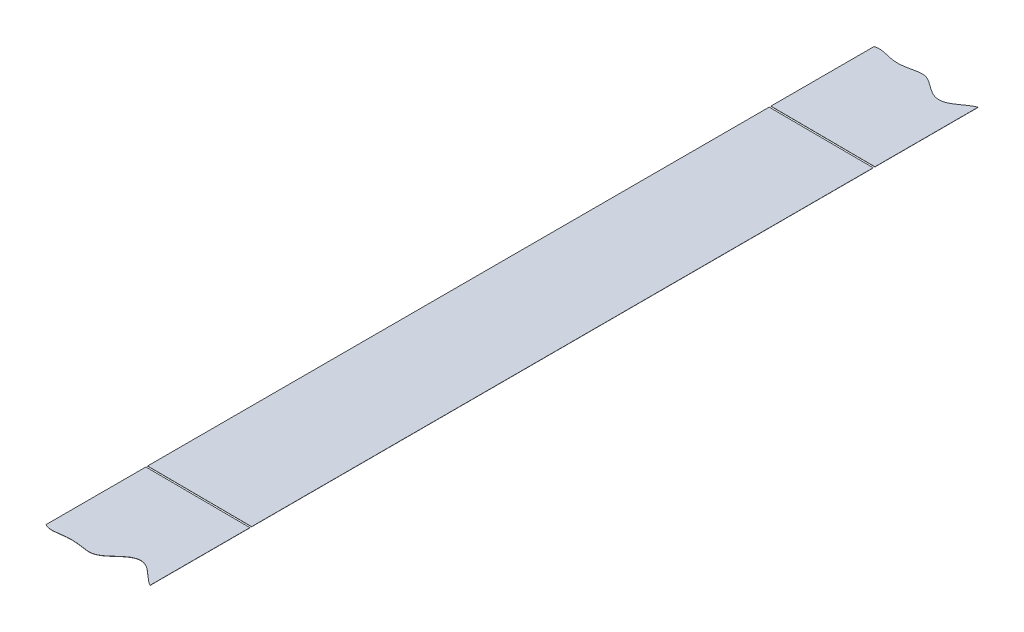
ISO-10303-21;
HEADER;
FILE_DESCRIPTION(('STEP AP214'),'2;1');
FILE_NAME('part.step','',(''),(''),'','','');
FILE_SCHEMA(('AUTOMOTIVE_DESIGN { 1 0 10303 214 1 1 1 1 }'));
ENDSEC;
DATA;
#1=APPLICATION_CONTEXT('core data for automotive mechanical design processes');
#2=APPLICATION_PROTOCOL_DEFINITION('international standard','automotive_design',2000,#1);
#3=PRODUCT_CONTEXT('',#1,'mechanical');
#4=PRODUCT('Part','Part','',(#3));
#5=PRODUCT_RELATED_PRODUCT_CATEGORY('part','',(#4));
#6=PRODUCT_DEFINITION_FORMATION('','',#4);
#7=PRODUCT_DEFINITION_CONTEXT('part definition',#1,'design');
#8=PRODUCT_DEFINITION('design','',#6,#7);
#9=PRODUCT_DEFINITION_SHAPE('','',#8);
#10=(LENGTH_UNIT() NAMED_UNIT(*) SI_UNIT(.MILLI.,.METRE.));
#11=(NAMED_UNIT(*) PLANE_ANGLE_UNIT() SI_UNIT($,.RADIAN.));
#12=(NAMED_UNIT(*) SI_UNIT($,.STERADIAN.) SOLID_ANGLE_UNIT());
#13=UNCERTAINTY_MEASURE_WITH_UNIT(LENGTH_MEASURE(1.E-05),#10,'distance_accuracy_value','');
#14=(GEOMETRIC_REPRESENTATION_CONTEXT(3) GLOBAL_UNCERTAINTY_ASSIGNED_CONTEXT((#13)) GLOBAL_UNIT_ASSIGNED_CONTEXT((#10,
#11,#12)) REPRESENTATION_CONTEXT('',''));
#15=CARTESIAN_POINT('',(0.,0.,0.));
#16=DIRECTION('',(0.,0.,1.));
#17=DIRECTION('',(1.,0.,0.));
#18=AXIS2_PLACEMENT_3D('',#15,#16,#17);
#19=CARTESIAN_POINT('',(5361.79707301312,-34.5969939588689,-4952.40178139495));
#20=DIRECTION('',(-0.00526315789472435,-0.999986149488569,0.));
#21=DIRECTION('',(0.999986149488569,-0.00526315789472435,0.));
#22=AXIS2_PLACEMENT_3D('',#19,#20,#21);
#23=PLANE('',#22);
#24=DIRECTION('',(0.,0.,-1.));
#25=VECTOR('',#24,1.);
#26=CARTESIAN_POINT('',(593.409266168176,-9.49986842014141,292.897456211538));
#27=LINE('',#26,#25);
#28=CARTESIAN_POINT('',(593.409266168176,-9.49986842014141,234.429573526086));
#29=VERTEX_POINT('',#28);
#30=CARTESIAN_POINT('',(593.409266168176,-9.49986842014141,-123.570426473914));
#31=VERTEX_POINT('',#30);
#32=EDGE_CURVE('E53',#29,#31,#27,.T.);
#33=ORIENTED_EDGE('',*,*,#32,.T.);
#34=DIRECTION('',(-0.999986149488569,0.00526315789472435,0.));
#35=VECTOR('',#34,1.);
#36=CARTESIAN_POINT('',(5361.79707301312,-34.5969939588688,-123.570426473914));
#37=LINE('',#36,#35);
#38=CARTESIAN_POINT('',(533.50620296407,-9.18458477328079,-123.570426473914));
#39=VERTEX_POINT('',#38);
#40=EDGE_CURVE('E68',#31,#39,#37,.T.);
#41=ORIENTED_EDGE('',*,*,#40,.T.);
#42=DIRECTION('',(0.,0.,-1.));
#43=VECTOR('',#42,1.);
#44=CARTESIAN_POINT('',(533.50620296407,-9.18458477328079,292.948408765323));
#45=LINE('',#44,#43);
#46=CARTESIAN_POINT('',(533.506202964069,-9.18458477328079,234.429573526086));
#47=VERTEX_POINT('',#46);
#48=EDGE_CURVE('E110',#47,#39,#45,.T.);
#49=ORIENTED_EDGE('',*,*,#48,.F.);
#50=DIRECTION('',(0.999986149488569,-0.00526315789472435,0.));
#51=VECTOR('',#50,1.);
#52=CARTESIAN_POINT('',(5361.79707301312,-34.5969939588688,234.429573526086));
#53=LINE('',#52,#51);
#54=EDGE_CURVE('E116',#47,#29,#53,.T.);
#55=ORIENTED_EDGE('',*,*,#54,.T.);
#56=EDGE_LOOP('',(#33,#41,#49,#55));
#57=FACE_BOUND('',#56,.T.);
#58=ADVANCED_FACE('F50',(#57),#23,.F.);
#59=CARTESIAN_POINT('',(5361.79654669733,-34.6969925738177,-4952.40178139495));
#60=DIRECTION('',(-0.00526315789472435,-0.999986149488569,0.));
#61=DIRECTION('',(0.999986149488569,-0.00526315789472435,0.));
#62=AXIS2_PLACEMENT_3D('',#59,#60,#61);
#63=PLANE('',#62);
#64=DIRECTION('',(-0.999986149488569,0.00526315789472435,0.));
#65=VECTOR('',#64,1.);
#66=CARTESIAN_POINT('',(533.50567664828,-9.28458338822965,-123.570426473914));
#67=LINE('',#66,#65);
#68=CARTESIAN_POINT('',(593.408739852387,-9.59986703509027,-123.570426473914));
#69=VERTEX_POINT('',#68);
#70=CARTESIAN_POINT('',(533.50567664828,-9.28458338822965,-123.570426473914));
#71=VERTEX_POINT('',#70);
#72=EDGE_CURVE('E14',#69,#71,#67,.T.);
#73=ORIENTED_EDGE('',*,*,#72,.F.);
#74=DIRECTION('',(0.,0.,-1.));
#75=VECTOR('',#74,1.);
#76=CARTESIAN_POINT('',(593.408739852386,-9.59986703509026,292.897456211538));
#77=LINE('',#76,#75);
#78=CARTESIAN_POINT('',(593.408739852387,-9.59986703509027,234.429573526086));
#79=VERTEX_POINT('',#78);
#80=EDGE_CURVE('E98',#79,#69,#77,.T.);
#81=ORIENTED_EDGE('',*,*,#80,.F.);
#82=DIRECTION('',(0.999986149488569,-0.00526315789472435,0.));
#83=VECTOR('',#82,1.);
#84=CARTESIAN_POINT('',(533.50567664828,-9.28458338822965,234.429573526086));
#85=LINE('',#84,#83);
#86=CARTESIAN_POINT('',(533.50567664828,-9.28458338822965,234.429573526086));
#87=VERTEX_POINT('',#86);
#88=EDGE_CURVE('E91',#87,#79,#85,.T.);
#89=ORIENTED_EDGE('',*,*,#88,.F.);
#90=DIRECTION('',(0.,0.,-1.));
#91=VECTOR('',#90,1.);
#92=CARTESIAN_POINT('',(533.50567664828,-9.28458338822965,292.948408765323));
#93=LINE('',#92,#91);
#94=EDGE_CURVE('E100',#87,#71,#93,.T.);
#95=ORIENTED_EDGE('',*,*,#94,.T.);
#96=EDGE_LOOP('',(#73,#81,#89,#95));
#97=FACE_BOUND('',#96,.T.);
#98=ADVANCED_FACE('F96',(#97),#63,.T.);
#99=CARTESIAN_POINT('',(533.50567664828,-9.28458338822965,292.948408765323));
#100=DIRECTION('',(0.999986149488569,-0.00526315789473041,0.));
#101=DIRECTION('',(0.00526315789473041,0.999986149488569,0.));
#102=AXIS2_PLACEMENT_3D('',#99,#100,#101);
#103=PLANE('',#102);
#104=ORIENTED_EDGE('',*,*,#48,.T.);
#105=DIRECTION('',(-0.00526315789472435,-0.999986149488569,0.));
#106=VECTOR('',#105,1.);
#107=CARTESIAN_POINT('',(533.558308227227,0.71527810665604,-123.570426473914));
#108=LINE('',#107,#106);
#109=EDGE_CURVE('E107',#39,#71,#108,.T.);
#110=ORIENTED_EDGE('',*,*,#109,.T.);
#111=ORIENTED_EDGE('',*,*,#94,.F.);
#112=DIRECTION('',(-0.00526315789472435,-0.999986149488569,0.));
#113=VECTOR('',#112,1.);
#114=CARTESIAN_POINT('',(533.558308227227,0.71527810665604,234.429573526086));
#115=LINE('',#114,#113);
#116=EDGE_CURVE('E104',#47,#87,#115,.T.);
#117=ORIENTED_EDGE('',*,*,#116,.F.);
#118=EDGE_LOOP('',(#104,#110,#111,#117));
#119=FACE_BOUND('',#118,.T.);
#120=ADVANCED_FACE('F124',(#119),#103,.F.);
#121=CARTESIAN_POINT('',(593.408739852386,-9.59986703509026,292.897456211538));
#122=DIRECTION('',(0.999986149488569,-0.00526315789473041,0.));
#123=DIRECTION('',(0.00526315789473041,0.999986149488569,0.));
#124=AXIS2_PLACEMENT_3D('',#121,#122,#123);
#125=PLANE('',#124);
#126=DIRECTION('',(-0.00526315789473041,-0.999986149488569,0.));
#127=VECTOR('',#126,1.);
#128=CARTESIAN_POINT('',(593.408739852386,-9.59986703509026,-123.570426473914));
#129=LINE('',#128,#127);
#130=EDGE_CURVE('E59',#31,#69,#129,.T.);
#131=ORIENTED_EDGE('',*,*,#130,.F.);
#132=ORIENTED_EDGE('',*,*,#32,.F.);
#133=DIRECTION('',(-0.00526315789472435,-0.999986149488569,0.));
#134=VECTOR('',#133,1.);
#135=CARTESIAN_POINT('',(593.461371431334,0.399994459795421,234.429573526086));
#136=LINE('',#135,#134);
#137=EDGE_CURVE('E103',#29,#79,#136,.T.);
#138=ORIENTED_EDGE('',*,*,#137,.T.);
#139=ORIENTED_EDGE('',*,*,#80,.T.);
#140=EDGE_LOOP('',(#131,#132,#138,#139));
#141=FACE_BOUND('',#140,.T.);
#142=ADVANCED_FACE('F102',(#141),#125,.T.);
#143=CARTESIAN_POINT('',(533.558308227227,0.71527810665604,234.429573526086));
#144=DIRECTION('',(0.,0.,-1.));
#145=DIRECTION('',(0.,1.,0.));
#146=AXIS2_PLACEMENT_3D('',#143,#144,#145);
#147=PLANE('',#146);
#148=ORIENTED_EDGE('',*,*,#116,.T.);
#149=ORIENTED_EDGE('',*,*,#88,.T.);
#150=ORIENTED_EDGE('',*,*,#137,.F.);
#151=ORIENTED_EDGE('',*,*,#54,.F.);
#152=EDGE_LOOP('',(#148,#149,#150,#151));
#153=FACE_BOUND('',#152,.T.);
#154=ADVANCED_FACE('F123',(#153),#147,.F.);
#155=CARTESIAN_POINT('',(533.558308227227,0.71527810665604,-123.570426473914));
#156=DIRECTION('',(0.,0.,1.));
#157=DIRECTION('',(0.,-1.,0.));
#158=AXIS2_PLACEMENT_3D('',#155,#156,#157);
#159=PLANE('',#158);
#160=ORIENTED_EDGE('',*,*,#130,.T.);
#161=ORIENTED_EDGE('',*,*,#72,.T.);
#162=ORIENTED_EDGE('',*,*,#109,.F.);
#163=ORIENTED_EDGE('',*,*,#40,.F.);
#164=EDGE_LOOP('',(#160,#161,#162,#163));
#165=FACE_BOUND('',#164,.T.);
#166=ADVANCED_FACE('F86',(#165),#159,.F.);
#167=CLOSED_SHELL('',(#58,#98,#120,#142,#154,#166));
#168=MANIFOLD_SOLID_BREP('B2',#167);
#169=CARTESIAN_POINT('',(593.408739852386,-9.59986703509026,292.897456211538));
#170=DIRECTION('',(0.999986149488569,-0.00526315789473041,0.));
#171=DIRECTION('',(0.00526315789473041,0.999986149488569,0.));
#172=AXIS2_PLACEMENT_3D('',#169,#170,#171);
#173=PLANE('',#172);
#174=DIRECTION('',(-0.00526315789472435,-0.999986149488569,0.));
#175=VECTOR('',#174,1.);
#176=CARTESIAN_POINT('',(593.461371431334,0.399994459795421,235.429573526086));
#177=LINE('',#176,#175);
#178=CARTESIAN_POINT('',(593.409266168176,-9.49986842014141,235.429573526086));
#179=VERTEX_POINT('',#178);
#180=CARTESIAN_POINT('',(593.408739852387,-9.59986703509027,235.429573526086));
#181=VERTEX_POINT('',#180);
#182=EDGE_CURVE('E192',#179,#181,#177,.T.);
#183=ORIENTED_EDGE('',*,*,#182,.F.);
#184=DIRECTION('',(0.,0.,-1.));
#185=VECTOR('',#184,1.);
#186=CARTESIAN_POINT('',(593.409266168176,-9.49986842014141,292.897456211538));
#187=LINE('',#186,#185);
#188=CARTESIAN_POINT('',(593.409266168176,-9.49986842014141,292.89745621154));
#189=VERTEX_POINT('',#188);
#190=EDGE_CURVE('E186',#189,#179,#187,.T.);
#191=ORIENTED_EDGE('',*,*,#190,.F.);
#192=DIRECTION('',(0.00526315789473041,0.999986149488569,0.));
#193=VECTOR('',#192,1.);
#194=CARTESIAN_POINT('',(593.408739852386,-9.59986703509026,292.89745621154));
#195=LINE('',#194,#193);
#196=CARTESIAN_POINT('',(593.408739852386,-9.59986703509026,292.89745621154));
#197=VERTEX_POINT('',#196);
#198=EDGE_CURVE('E218',#197,#189,#195,.T.);
#199=ORIENTED_EDGE('',*,*,#198,.F.);
#200=DIRECTION('',(0.,0.,-1.));
#201=VECTOR('',#200,1.);
#202=CARTESIAN_POINT('',(593.408739852386,-9.59986703509026,292.897456211538));
#203=LINE('',#202,#201);
#204=EDGE_CURVE('E231',#197,#181,#203,.T.);
#205=ORIENTED_EDGE('',*,*,#204,.T.);
#206=EDGE_LOOP('',(#183,#191,#199,#205));
#207=FACE_BOUND('',#206,.T.);
#208=ADVANCED_FACE('F183',(#207),#173,.T.);
#209=CARTESIAN_POINT('',(533.50567664828,-9.28458338822965,292.948408765323));
#210=DIRECTION('',(0.999986149488569,-0.00526315789473041,0.));
#211=DIRECTION('',(0.00526315789473041,0.999986149488569,0.));
#212=AXIS2_PLACEMENT_3D('',#209,#210,#211);
#213=PLANE('',#212);
#214=DIRECTION('',(0.,0.,-1.));
#215=VECTOR('',#214,1.);
#216=CARTESIAN_POINT('',(533.50620296407,-9.18458477328079,292.948408765323));
#217=LINE('',#216,#215);
#218=CARTESIAN_POINT('',(533.50620296407,-9.18458477328079,292.948408765325));
#219=VERTEX_POINT('',#218);
#220=CARTESIAN_POINT('',(533.50620296407,-9.18458477328079,235.429573526086));
#221=VERTEX_POINT('',#220);
#222=EDGE_CURVE('E242',#219,#221,#217,.T.);
#223=ORIENTED_EDGE('',*,*,#222,.T.);
#224=DIRECTION('',(-0.00526315789472435,-0.999986149488569,0.));
#225=VECTOR('',#224,1.);
#226=CARTESIAN_POINT('',(533.558308227227,0.71527810665604,235.429573526086));
#227=LINE('',#226,#225);
#228=CARTESIAN_POINT('',(533.50567664828,-9.28458338822965,235.429573526086));
#229=VERTEX_POINT('',#228);
#230=EDGE_CURVE('E245',#221,#229,#227,.T.);
#231=ORIENTED_EDGE('',*,*,#230,.T.);
#232=DIRECTION('',(0.,0.,-1.));
#233=VECTOR('',#232,1.);
#234=CARTESIAN_POINT('',(533.50567664828,-9.28458338822965,292.948408765323));
#235=LINE('',#234,#233);
#236=CARTESIAN_POINT('',(533.50567664828,-9.28458338822965,292.948408765325));
#237=VERTEX_POINT('',#236);
#238=EDGE_CURVE('E239',#237,#229,#235,.T.);
#239=ORIENTED_EDGE('',*,*,#238,.F.);
#240=DIRECTION('',(0.00526315789473041,0.999986149488569,0.));
#241=VECTOR('',#240,1.);
#242=CARTESIAN_POINT('',(533.50567664828,-9.28458338822965,292.948408765325));
#243=LINE('',#242,#241);
#244=EDGE_CURVE('E237',#237,#219,#243,.T.);
#245=ORIENTED_EDGE('',*,*,#244,.T.);
#246=EDGE_LOOP('',(#223,#231,#239,#245));
#247=FACE_BOUND('',#246,.T.);
#248=ADVANCED_FACE('F270',(#247),#213,.F.);
#249=CARTESIAN_POINT('',(5361.79654669733,-34.6969925738177,-4952.40178139495));
#250=DIRECTION('',(-0.00526315789472435,-0.999986149488569,0.));
#251=DIRECTION('',(0.999986149488569,-0.00526315789472435,0.));
#252=AXIS2_PLACEMENT_3D('',#249,#250,#251);
#253=PLANE('',#252);
#254=DIRECTION('',(-0.999986149488569,0.00526315789472435,0.));
#255=VECTOR('',#254,1.);
#256=CARTESIAN_POINT('',(533.50567664828,-9.28458338822965,235.429573526086));
#257=LINE('',#256,#255);
#258=EDGE_CURVE('E48',#181,#229,#257,.T.);
#259=ORIENTED_EDGE('',*,*,#258,.F.);
#260=ORIENTED_EDGE('',*,*,#204,.F.);
#261=CARTESIAN_POINT('',(593.408739852385,-9.59986703509026,292.89745621154));
#262=CARTESIAN_POINT('',(592.963554284228,-9.59752392069927,292.668857715862));
#263=CARTESIAN_POINT('',(592.087816417687,-9.59291471019335,292.118684120237));
#264=CARTESIAN_POINT('',(591.248996343615,-9.58849980654957,291.509944053657));
#265=CARTESIAN_POINT('',(590.442384741014,-9.58425442352464,290.86185062097));
#266=CARTESIAN_POINT('',(589.667401944146,-9.58017551020399,290.195409338944));
#267=CARTESIAN_POINT('',(589.245965295253,-9.57795739185617,289.817740107904));
#268=CARTESIAN_POINT('',(588.930392345636,-9.57629645859026,289.534940324041));
#269=CARTESIAN_POINT('',(588.480561483757,-9.5739288949463,289.124048410006));
#270=CARTESIAN_POINT('',(588.362804588767,-9.57330911323048,289.016484967668));
#271=CARTESIAN_POINT('',(587.850788918906,-9.57061425659029,288.547813141705));
#272=CARTESIAN_POINT('',(587.715510140024,-9.56990225315562,288.424314918726));
#273=CARTESIAN_POINT('',(587.269069339123,-9.56755253218499,288.0167517663));
#274=CARTESIAN_POINT('',(586.9432851855,-9.56583785499572,287.725047822506));
#275=CARTESIAN_POINT('',(586.524826533455,-9.5636354105326,287.350364039521));
#276=CARTESIAN_POINT('',(585.750225354687,-9.55955850575609,286.682785190168));
#277=CARTESIAN_POINT('',(585.373275176842,-9.55757452997258,286.376349281316));
#278=CARTESIAN_POINT('',(584.491365901281,-9.55293283791666,285.659414560853));
#279=CARTESIAN_POINT('',(583.707049579263,-9.54880480009904,285.134772192646));
#280=CARTESIAN_POINT('',(582.772416510785,-9.54388561055272,284.509580426666));
#281=CARTESIAN_POINT('',(581.898596215426,-9.53928649266649,284.103861028012));
#282=CARTESIAN_POINT('',(580.89395600265,-9.53399883936256,283.637401247716));
#283=CARTESIAN_POINT('',(579.188287606807,-9.52502151293864,283.288618951137));
#284=CARTESIAN_POINT('',(577.987018396949,-9.51869895584243,283.288613184379));
#285=CARTESIAN_POINT('',(577.278802959304,-9.51497145454283,283.382271241027));
#286=CARTESIAN_POINT('',(576.815503230361,-9.51253300114299,283.473790908428));
#287=CARTESIAN_POINT('',(576.134834287326,-9.50895048340205,283.650753363707));
#288=CARTESIAN_POINT('',(575.259072576202,-9.5043411473966,283.98418002776));
#289=CARTESIAN_POINT('',(574.400552513059,-9.49982255816372,284.402566873215));
#290=CARTESIAN_POINT('',(573.585546134558,-9.49553299149577,284.882523700597));
#291=CARTESIAN_POINT('',(572.804269051482,-9.49142094989412,285.406439317279));
#292=CARTESIAN_POINT('',(572.034886412254,-9.48737151149562,285.979687739538));
#293=CARTESIAN_POINT('',(571.464287003118,-9.4843683151149,286.43933082301));
#294=CARTESIAN_POINT('',(571.101652869472,-9.48245968797603,286.740681087442));
#295=CARTESIAN_POINT('',(570.738301330116,-9.48054728496535,287.050502058306));
#296=CARTESIAN_POINT('',(570.386408172175,-9.47869519006058,287.357349513566));
#297=CARTESIAN_POINT('',(570.030757138571,-9.4768233165889,287.672752317475));
#298=CARTESIAN_POINT('',(569.697010375132,-9.47506673034644,287.972979609665));
#299=CARTESIAN_POINT('',(569.355235305262,-9.47326788927437,288.283194373987));
#300=CARTESIAN_POINT('',(569.0867475701,-9.47185477635907,288.528388967851));
#301=CARTESIAN_POINT('',(568.975090889061,-9.47126710147717,288.630551358953));
#302=CARTESIAN_POINT('',(568.859494183026,-9.47065868933438,288.736337491476));
#303=CARTESIAN_POINT('',(568.630193392143,-9.46945182635091,288.946177760145));
#304=CARTESIAN_POINT('',(568.609573620285,-9.46934329973271,288.965040465643));
#305=CARTESIAN_POINT('',(568.510259004396,-9.46882058398816,289.055892215309));
#306=CARTESIAN_POINT('',(568.340048420131,-9.46792472639973,289.211362012757));
#307=CARTESIAN_POINT('',(568.169437153311,-9.46702675992654,289.366814622559));
#308=CARTESIAN_POINT('',(567.888544650268,-9.46554835785496,289.621691187699));
#309=CARTESIAN_POINT('',(567.547368133273,-9.46375266710481,289.928136827792));
#310=CARTESIAN_POINT('',(567.004627097783,-9.4608960957741,290.408438725594));
#311=CARTESIAN_POINT('',(566.291653145525,-9.45714354931386,291.011774864761));
#312=CARTESIAN_POINT('',(565.513364779839,-9.45304723802162,291.626935240072));
#313=CARTESIAN_POINT('',(564.667852243881,-9.44859711040636,292.226547613232));
#314=CARTESIAN_POINT('',(563.780357911482,-9.44392602290731,292.765927718913));
#315=CARTESIAN_POINT('',(562.850831173444,-9.4390337091566,293.221200924172));
#316=CARTESIAN_POINT('',(561.877772741271,-9.43391227805285,293.574436714818));
#317=CARTESIAN_POINT('',(560.871855288122,-9.42861790233806,293.811772467039));
#318=CARTESIAN_POINT('',(559.847022189664,-9.4232239692164,293.93622552506));
#319=CARTESIAN_POINT('',(558.810652095491,-9.41776931422364,293.962621322036));
#320=CARTESIAN_POINT('',(557.776166646686,-9.4123245785544,293.913237901388));
#321=CARTESIAN_POINT('',(556.751203219656,-9.4069299594834,293.812231608406));
#322=CARTESIAN_POINT('',(556.179456424847,-9.40392072414706,293.738276239415));
#323=CARTESIAN_POINT('',(555.760255552368,-9.40171437320651,293.68405266442));
#324=CARTESIAN_POINT('',(555.148173987131,-9.39849284666443,293.596492879749));
#325=CARTESIAN_POINT('',(554.989716997915,-9.3976588509594,293.57382521478));
#326=CARTESIAN_POINT('',(554.296516300029,-9.39401037570044,293.473664284724));
#327=CARTESIAN_POINT('',(554.111964419162,-9.39303903655813,293.447320082057));
#328=CARTESIAN_POINT('',(553.522102010748,-9.38993445456643,293.363119071699));
#329=CARTESIAN_POINT('',(553.080525514004,-9.38761033555123,293.305227323628));
#330=CARTESIAN_POINT('',(552.533490869311,-9.38473116596436,293.233509756975));
#331=CARTESIAN_POINT('',(550.956351245818,-9.37643031613287,293.059036170687));
#332=CARTESIAN_POINT('',(548.92282537081,-9.36572740012883,292.955099949587));
#333=CARTESIAN_POINT('',(546.882263041203,-9.35498744964028,292.994625932319));
#334=CARTESIAN_POINT('',(545.311882502684,-9.34672217443296,293.129308380252));
#335=CARTESIAN_POINT('',(544.289871313085,-9.34134309366891,293.244467008328));
#336=CARTESIAN_POINT('',(543.737223024079,-9.33843437817643,293.317736098255));
#337=CARTESIAN_POINT('',(543.304828863757,-9.33615858791704,293.375062117799));
#338=CARTESIAN_POINT('',(542.708593333695,-9.33302046271523,293.460486941518));
#339=CARTESIAN_POINT('',(542.559354709606,-9.3322349853934,293.481868899674));
#340=CARTESIAN_POINT('',(541.860517058371,-9.328556841548,293.58283583796));
#341=CARTESIAN_POINT('',(541.674000390186,-9.32757516127657,293.609405272512));
#342=CARTESIAN_POINT('',(541.06817611466,-9.32438656829438,293.695705379597));
#343=CARTESIAN_POINT('',(540.640975799143,-9.3221381144389,293.750109926116));
#344=CARTESIAN_POINT('',(540.076881596549,-9.31916915646156,293.821948097045));
#345=CARTESIAN_POINT('',(539.055514354743,-9.31379346494336,293.919267398302));
#346=CARTESIAN_POINT('',(538.020806237623,-9.3083475573194,293.963621201371));
#347=CARTESIAN_POINT('',(536.986081278241,-9.30290156105072,293.930292891589));
#348=CARTESIAN_POINT('',(535.958399548802,-9.29749263492677,293.797178187986));
#349=CARTESIAN_POINT('',(534.954108397823,-9.29220681881564,293.54962305101));
#350=CARTESIAN_POINT('',(533.984968578383,-9.28710601227508,293.188162379464));
#351=CARTESIAN_POINT('',(533.505676648279,-9.28458338822964,292.948408765325));
#352=B_SPLINE_CURVE_WITH_KNOTS('',2,(#261,#262,#263,#264,#265,#266,#267,#268,#269,#270,#271,
#272,#273,#274,#275,#276,#277,#278,#279,#280,#281,#282,#283,#284,#285,#286,#287,#288,#289,#290,
#291,#292,#293,#294,#295,#296,#297,#298,#299,#300,#301,#302,#303,#304,#305,#306,#307,#308,#309,
#310,#311,#312,#313,#314,#315,#316,#317,#318,#319,#320,#321,#322,#323,#324,#325,#326,#327,#328,
#329,#330,#331,#332,#333,#334,#335,#336,#337,#338,#339,#340,#341,#342,#343,#344,#345,#346,#347,
#348,#349,#350,#351),.UNSPECIFIED.,.F.,.F.,(3,1,1,1,1,2,2,1,2,2,1,2,2,2,1,1,1,1,1,1,1,1,1,1,1,1,
1,1,1,1,1,1,1,2,2,1,1,1,1,1,1,1,1,1,1,1,1,1,1,1,1,2,2,1,2,2,1,1,1,1,1,2,2,1,2,2,1,1,1,1,1,1,3),
(0.,0.015625,0.03125,0.046875,0.0625,0.078125,0.09375,0.1015625,0.109375,0.125,0.140625,0.15625,
0.1875,0.21875,0.25,0.271918296813965,0.286173403263092,0.293300956487656,0.300428509712219,
0.314683616161346,0.328938722610474,0.343193829059601,0.357448935508728,0.371704041957855,
0.385959148406982,0.393086701631546,0.40021425485611,0.407341808080673,0.414469361305237,
0.4215969145298,0.428724467754364,0.435852020978928,0.439415797591209,0.442979574203491,
0.446543350815773,0.450107127428055,0.453670904040337,0.457234680652618,0.464362233877182,
0.471489787101746,0.485744893550873,0.5,0.515625,0.53125,0.546875,0.5625,0.578125,0.59375,
0.609375,0.625,0.640625,0.65625,0.671875,0.6796875,0.6875,0.703125,0.71875,0.75,0.78125,0.8125,
0.828125,0.84375,0.859375,0.8671875,0.875,0.890625,0.90625,0.921875,0.9375,0.953125,0.96875,
0.984375,1.),.UNSPECIFIED.);
#353=EDGE_CURVE('E226',#197,#237,#352,.T.);
#354=ORIENTED_EDGE('',*,*,#353,.T.);
#355=ORIENTED_EDGE('',*,*,#238,.T.);
#356=EDGE_LOOP('',(#259,#260,#354,#355));
#357=FACE_BOUND('',#356,.T.);
#358=ADVANCED_FACE('F241',(#357),#253,.T.);
#359=CARTESIAN_POINT('',(5361.79707301312,-34.5969939588689,-4952.40178139495));
#360=DIRECTION('',(-0.00526315789472435,-0.999986149488569,0.));
#361=DIRECTION('',(0.999986149488569,-0.00526315789472435,0.));
#362=AXIS2_PLACEMENT_3D('',#359,#360,#361);
#363=PLANE('',#362);
#364=ORIENTED_EDGE('',*,*,#190,.T.);
#365=DIRECTION('',(-0.999986149488569,0.00526315789472435,0.));
#366=VECTOR('',#365,1.);
#367=CARTESIAN_POINT('',(5361.79707301312,-34.5969939588688,235.429573526086));
#368=LINE('',#367,#366);
#369=EDGE_CURVE('E201',#179,#221,#368,.T.);
#370=ORIENTED_EDGE('',*,*,#369,.T.);
#371=ORIENTED_EDGE('',*,*,#222,.F.);
#372=CARTESIAN_POINT('',(593.409266168175,-9.49986842014141,292.89745621154));
#373=CARTESIAN_POINT('',(592.964080600018,-9.49752530575041,292.668857715862));
#374=CARTESIAN_POINT('',(592.088342733477,-9.49291609524449,292.118684120237));
#375=CARTESIAN_POINT('',(591.249522659404,-9.48850119160071,291.509944053657));
#376=CARTESIAN_POINT('',(590.442911056804,-9.48425580857578,290.86185062097));
#377=CARTESIAN_POINT('',(589.667928259936,-9.48017689525514,290.195409338944));
#378=CARTESIAN_POINT('',(589.246491611043,-9.47795877690731,289.817740107904));
#379=CARTESIAN_POINT('',(588.930918661425,-9.4762978436414,289.534940324041));
#380=CARTESIAN_POINT('',(588.481087799547,-9.47393027999744,289.124048410006));
#381=CARTESIAN_POINT('',(588.363330904556,-9.47331049828163,289.016484967668));
#382=CARTESIAN_POINT('',(587.851315234696,-9.47061564164143,288.547813141705));
#383=CARTESIAN_POINT('',(587.716036455814,-9.46990363820676,288.424314918726));
#384=CARTESIAN_POINT('',(587.269595654913,-9.46755391723613,288.0167517663));
#385=CARTESIAN_POINT('',(586.943811501289,-9.46583924004686,287.725047822506));
#386=CARTESIAN_POINT('',(586.525352849244,-9.46363679558375,287.350364039521));
#387=CARTESIAN_POINT('',(585.750751670476,-9.45955989080723,286.682785190168));
#388=CARTESIAN_POINT('',(585.373801492632,-9.45757591502372,286.376349281316));
#389=CARTESIAN_POINT('',(584.491892217071,-9.45293422296781,285.659414560853));
#390=CARTESIAN_POINT('',(583.707575895052,-9.44880618515018,285.134772192646));
#391=CARTESIAN_POINT('',(582.772942826574,-9.44388699560386,284.509580426666));
#392=CARTESIAN_POINT('',(581.899122531215,-9.43928787771764,284.103861028012));
#393=CARTESIAN_POINT('',(580.894482318439,-9.4340002244137,283.637401247716));
#394=CARTESIAN_POINT('',(579.188813922596,-9.42502289798978,283.288618951137));
#395=CARTESIAN_POINT('',(577.987544712738,-9.41870034089358,283.288613184379));
#396=CARTESIAN_POINT('',(577.279329275093,-9.41497283959397,283.382271241027));
#397=CARTESIAN_POINT('',(576.81602954615,-9.41253438619413,283.473790908428));
#398=CARTESIAN_POINT('',(576.135360603115,-9.4089518684532,283.650753363707));
#399=CARTESIAN_POINT('',(575.259598891991,-9.40434253244774,283.98418002776));
#400=CARTESIAN_POINT('',(574.401078828848,-9.39982394321486,284.402566873215));
#401=CARTESIAN_POINT('',(573.586072450348,-9.39553437654691,284.882523700597));
#402=CARTESIAN_POINT('',(572.804795367271,-9.39142233494527,285.406439317279));
#403=CARTESIAN_POINT('',(572.035412728043,-9.38737289654676,285.979687739538));
#404=CARTESIAN_POINT('',(571.464813318908,-9.38436970016604,286.43933082301));
#405=CARTESIAN_POINT('',(571.102179185261,-9.38246107302718,286.740681087442));
#406=CARTESIAN_POINT('',(570.738827645905,-9.38054867001649,287.050502058306));
#407=CARTESIAN_POINT('',(570.386934487964,-9.37869657511172,287.357349513566));
#408=CARTESIAN_POINT('',(570.031283454361,-9.37682470164004,287.672752317475));
#409=CARTESIAN_POINT('',(569.697536690922,-9.37506811539759,287.972979609665));
#410=CARTESIAN_POINT('',(569.355761621051,-9.37326927432551,288.283194373987));
#411=CARTESIAN_POINT('',(569.08727388589,-9.37185616141022,288.528388967851));
#412=CARTESIAN_POINT('',(568.975617204851,-9.37126848652831,288.630551358953));
#413=CARTESIAN_POINT('',(568.860020498815,-9.37066007438552,288.736337491476));
#414=CARTESIAN_POINT('',(568.630719707932,-9.36945321140205,288.946177760145));
#415=CARTESIAN_POINT('',(568.610099936074,-9.36934468478385,288.965040465643));
#416=CARTESIAN_POINT('',(568.510785320186,-9.3688219690393,289.055892215309));
#417=CARTESIAN_POINT('',(568.34057473592,-9.36792611145087,289.211362012757));
#418=CARTESIAN_POINT('',(568.1699634691,-9.36702814497768,289.366814622559));
#419=CARTESIAN_POINT('',(567.889070966057,-9.3655497429061,289.621691187699));
#420=CARTESIAN_POINT('',(567.547894449063,-9.36375405215595,289.928136827792));
#421=CARTESIAN_POINT('',(567.005153413573,-9.36089748082525,290.408438725594));
#422=CARTESIAN_POINT('',(566.292179461315,-9.357144934365,291.011774864761));
#423=CARTESIAN_POINT('',(565.513891095629,-9.35304862307276,291.626935240072));
#424=CARTESIAN_POINT('',(564.668378559671,-9.34859849545751,292.226547613232));
#425=CARTESIAN_POINT('',(563.780884227271,-9.34392740795846,292.765927718913));
#426=CARTESIAN_POINT('',(562.851357489233,-9.33903509420775,293.221200924172));
#427=CARTESIAN_POINT('',(561.87829905706,-9.33391366310399,293.574436714818));
#428=CARTESIAN_POINT('',(560.872381603912,-9.3286192873892,293.811772467039));
#429=CARTESIAN_POINT('',(559.847548505453,-9.32322535426754,293.93622552506));
#430=CARTESIAN_POINT('',(558.811178411281,-9.31777069927478,293.962621322036));
#431=CARTESIAN_POINT('',(557.776692962475,-9.31232596360555,293.913237901388));
#432=CARTESIAN_POINT('',(556.751729535446,-9.30693134453454,293.812231608406));
#433=CARTESIAN_POINT('',(556.179982740637,-9.30392210919821,293.738276239415));
#434=CARTESIAN_POINT('',(555.760781868157,-9.30171575825766,293.68405266442));
#435=CARTESIAN_POINT('',(555.14870030292,-9.29849423171557,293.596492879749));
#436=CARTESIAN_POINT('',(554.990243313704,-9.29766023601054,293.57382521478));
#437=CARTESIAN_POINT('',(554.297042615818,-9.29401176075159,293.473664284724));
#438=CARTESIAN_POINT('',(554.112490734951,-9.29304042160927,293.447320082057));
#439=CARTESIAN_POINT('',(553.522628326538,-9.28993583961757,293.363119071699));
#440=CARTESIAN_POINT('',(553.081051829794,-9.28761172060238,293.305227323628));
#441=CARTESIAN_POINT('',(552.5340171851,-9.2847325510155,293.233509756975));
#442=CARTESIAN_POINT('',(550.956877561608,-9.27643170118402,293.059036170687));
#443=CARTESIAN_POINT('',(548.923351686599,-9.26572878517998,292.955099949587));
#444=CARTESIAN_POINT('',(546.882789356992,-9.25498883469143,292.994625932319));
#445=CARTESIAN_POINT('',(545.312408818473,-9.24672355948411,293.129308380252));
#446=CARTESIAN_POINT('',(544.290397628875,-9.24134447872005,293.244467008328));
#447=CARTESIAN_POINT('',(543.737749339869,-9.23843576322757,293.317736098255));
#448=CARTESIAN_POINT('',(543.305355179546,-9.23615997296818,293.375062117799));
#449=CARTESIAN_POINT('',(542.709119649484,-9.23302184776638,293.460486941518));
#450=CARTESIAN_POINT('',(542.559881025395,-9.23223637044455,293.481868899674));
#451=CARTESIAN_POINT('',(541.86104337416,-9.22855822659914,293.58283583796));
#452=CARTESIAN_POINT('',(541.674526705975,-9.22757654632771,293.609405272512));
#453=CARTESIAN_POINT('',(541.068702430449,-9.22438795334552,293.695705379597));
#454=CARTESIAN_POINT('',(540.641502114933,-9.22213949949004,293.750109926116));
#455=CARTESIAN_POINT('',(540.077407912339,-9.21917054151271,293.821948097045));
#456=CARTESIAN_POINT('',(539.056040670532,-9.21379484999451,293.919267398302));
#457=CARTESIAN_POINT('',(538.021332553412,-9.20834894237054,293.963621201371));
#458=CARTESIAN_POINT('',(536.986607594031,-9.20290294610187,293.930292891589));
#459=CARTESIAN_POINT('',(535.958925864591,-9.19749401997791,293.797178187986));
#460=CARTESIAN_POINT('',(534.954634713612,-9.19220820386678,293.54962305101));
#461=CARTESIAN_POINT('',(533.985494894172,-9.18710739732623,293.188162379464));
#462=CARTESIAN_POINT('',(533.506202964069,-9.18458477328079,292.948408765325));
#463=B_SPLINE_CURVE_WITH_KNOTS('',2,(#372,#373,#374,#375,#376,#377,#378,#379,#380,#381,#382,
#383,#384,#385,#386,#387,#388,#389,#390,#391,#392,#393,#394,#395,#396,#397,#398,#399,#400,#401,
#402,#403,#404,#405,#406,#407,#408,#409,#410,#411,#412,#413,#414,#415,#416,#417,#418,#419,#420,
#421,#422,#423,#424,#425,#426,#427,#428,#429,#430,#431,#432,#433,#434,#435,#436,#437,#438,#439,
#440,#441,#442,#443,#444,#445,#446,#447,#448,#449,#450,#451,#452,#453,#454,#455,#456,#457,#458,
#459,#460,#461,#462),.UNSPECIFIED.,.F.,.F.,(3,1,1,1,1,2,2,1,2,2,1,2,2,2,1,1,1,1,1,1,1,1,1,1,1,1,
1,1,1,1,1,1,1,2,2,1,1,1,1,1,1,1,1,1,1,1,1,1,1,1,1,2,2,1,2,2,1,1,1,1,1,2,2,1,2,2,1,1,1,1,1,1,3),
(0.,0.015625,0.03125,0.046875,0.0625,0.078125,0.09375,0.1015625,0.109375,0.125,0.140625,0.15625,
0.1875,0.21875,0.25,0.271918296813965,0.286173403263092,0.293300956487656,0.300428509712219,
0.314683616161346,0.328938722610474,0.343193829059601,0.357448935508728,0.371704041957855,
0.385959148406982,0.393086701631546,0.40021425485611,0.407341808080673,0.414469361305237,
0.4215969145298,0.428724467754364,0.435852020978928,0.439415797591209,0.442979574203491,
0.446543350815773,0.450107127428055,0.453670904040337,0.457234680652618,0.464362233877182,
0.471489787101746,0.485744893550873,0.5,0.515625,0.53125,0.546875,0.5625,0.578125,0.59375,
0.609375,0.625,0.640625,0.65625,0.671875,0.6796875,0.6875,0.703125,0.71875,0.75,0.78125,0.8125,
0.828125,0.84375,0.859375,0.8671875,0.875,0.890625,0.90625,0.921875,0.9375,0.953125,0.96875,
0.984375,1.),.UNSPECIFIED.);
#464=EDGE_CURVE('E233',#189,#219,#463,.T.);
#465=ORIENTED_EDGE('',*,*,#464,.F.);
#466=EDGE_LOOP('',(#364,#370,#371,#465));
#467=FACE_BOUND('',#466,.T.);
#468=ADVANCED_FACE('F263',(#467),#363,.F.);
#469=DIRECTION('',(0.00526315789473041,0.999986149488569,0.));
#470=VECTOR('',#469,1.);
#471=SURFACE_OF_LINEAR_EXTRUSION('',#352,#470);
#472=ORIENTED_EDGE('',*,*,#464,.T.);
#473=ORIENTED_EDGE('',*,*,#244,.F.);
#474=ORIENTED_EDGE('',*,*,#353,.F.);
#475=ORIENTED_EDGE('',*,*,#198,.T.);
#476=EDGE_LOOP('',(#472,#473,#474,#475));
#477=FACE_BOUND('',#476,.T.);
#478=ADVANCED_FACE('F235',(#477),#471,.F.);
#479=CARTESIAN_POINT('',(533.558308227227,0.71527810665604,235.429573526086));
#480=DIRECTION('',(0.,0.,1.));
#481=DIRECTION('',(0.,-1.,0.));
#482=AXIS2_PLACEMENT_3D('',#479,#480,#481);
#483=PLANE('',#482);
#484=ORIENTED_EDGE('',*,*,#182,.T.);
#485=ORIENTED_EDGE('',*,*,#258,.T.);
#486=ORIENTED_EDGE('',*,*,#230,.F.);
#487=ORIENTED_EDGE('',*,*,#369,.F.);
#488=EDGE_LOOP('',(#484,#485,#486,#487));
#489=FACE_BOUND('',#488,.T.);
#490=ADVANCED_FACE('F262',(#489),#483,.F.);
#491=CLOSED_SHELL('',(#208,#248,#358,#468,#478,#490));
#492=MANIFOLD_SOLID_BREP('B8',#491);
#493=CARTESIAN_POINT('',(533.505676648279,-9.28458338822964,-183.980420995036));
#494=CARTESIAN_POINT('',(533.99100357466,-9.28713777585332,-184.13427163458));
#495=CARTESIAN_POINT('',(534.972711984165,-9.29230473378414,-184.327558885761));
#496=CARTESIAN_POINT('',(535.970811146809,-9.29755796003159,-184.407129506605));
#497=CARTESIAN_POINT('',(536.971455779212,-9.30282458367387,-184.384283742296));
#498=CARTESIAN_POINT('',(537.967588865267,-9.30806746200649,-184.27872004235));
#499=CARTESIAN_POINT('',(538.94829013037,-9.31322911910386,-184.115108496928));
#500=CARTESIAN_POINT('',(539.481776089408,-9.31603697883119,-184.004853865176));
#501=CARTESIAN_POINT('',(539.908333199566,-9.31828204734842,-183.916698035945));
#502=CARTESIAN_POINT('',(540.469537829149,-9.32123579683611,-183.788728508385));
#503=CARTESIAN_POINT('',(540.723175649957,-9.32257075122489,-183.730892363796));
#504=CARTESIAN_POINT('',(541.450596248943,-9.32639933372106,-183.561295858359));
#505=CARTESIAN_POINT('',(542.059395698099,-9.32960358572872,-183.419355611915));
#506=CARTESIAN_POINT('',(542.429744592683,-9.3315528174349,-183.336153096137));
#507=CARTESIAN_POINT('',(542.966676381398,-9.3343788133591,-183.215526097446));
#508=CARTESIAN_POINT('',(543.418409982516,-9.33675639155881,-183.123075276455));
#509=CARTESIAN_POINT('',(544.47787088771,-9.34233257881918,-182.906248300885));
#510=CARTESIAN_POINT('',(545.392940050344,-9.34714879901382,-182.779053198342));
#511=CARTESIAN_POINT('',(546.423767848997,-9.35257428362615,-182.63576758354));
#512=CARTESIAN_POINT('',(548.403764645235,-9.36299546373447,-182.535859777063));
#513=CARTESIAN_POINT('',(550.384019998505,-9.37341800468812,-182.625833884632));
#514=CARTESIAN_POINT('',(551.413108269652,-9.3788343337657,-182.764467202696));
#515=CARTESIAN_POINT('',(552.338080649645,-9.38370267687891,-182.889074579683));
#516=CARTESIAN_POINT('',(553.402830401048,-9.38930670055751,-183.104480110677));
#517=CARTESIAN_POINT('',(553.854582729243,-9.39168437732214,-183.195872430802));
#518=CARTESIAN_POINT('',(554.384993765182,-9.39447605301954,-183.314235349491));
#519=CARTESIAN_POINT('',(554.807041815588,-9.39669738931463,-183.408416721464));
#520=CARTESIAN_POINT('',(555.614409736494,-9.40094675301735,-183.596915651047));
#521=CARTESIAN_POINT('',(556.148359548023,-9.4037570541074,-183.721243798149));
#522=CARTESIAN_POINT('',(556.351682052422,-9.40482718737349,-183.76783416822));
#523=CARTESIAN_POINT('',(556.911812015304,-9.4077752806423,-183.896185244437));
#524=CARTESIAN_POINT('',(557.330449836591,-9.40997866811448,-183.983953721546));
#525=CARTESIAN_POINT('',(557.865611995407,-9.41279535006809,-184.096151820468));
#526=CARTESIAN_POINT('',(558.848349240755,-9.41796772299941,-184.264973793634));
#527=CARTESIAN_POINT('',(559.842835005119,-9.42320193109776,-184.377070666936));
#528=CARTESIAN_POINT('',(560.843737133906,-9.42846991000293,-184.409290819561));
#529=CARTESIAN_POINT('',(561.842031214261,-9.43372416214729,-184.340193550791));
#530=CARTESIAN_POINT('',(562.822338138276,-9.43888374373652,-184.159203059577));
#531=CARTESIAN_POINT('',(563.779409785694,-9.44392103270247,-183.867505790442));
#532=CARTESIAN_POINT('',(564.703232012141,-9.44878332229212,-183.479306983474));
#533=CARTESIAN_POINT('',(565.589054209728,-9.45344560895973,-183.018148625669));
#534=CARTESIAN_POINT('',(566.444254011702,-9.45794672289178,-182.503079225233));
#535=CARTESIAN_POINT('',(567.269058785219,-9.4622878607741,-181.955848527292));
#536=CARTESIAN_POINT('',(567.707394520609,-9.46459492291435,-181.647247073634));
#537=CARTESIAN_POINT('',(568.056286845959,-9.46643122374464,-181.401616452902));
#538=CARTESIAN_POINT('',(568.652979961853,-9.46957175732627,-180.968642826164));
#539=CARTESIAN_POINT('',(568.979615949184,-9.47129091791295,-180.730417857172));
#540=CARTESIAN_POINT('',(569.281413246374,-9.47287934674081,-180.510039857355));
#541=CARTESIAN_POINT('',(569.627962601791,-9.47470331597959,-180.257393891886));
#542=CARTESIAN_POINT('',(569.988635611076,-9.47660162126832,-179.995872295841));
#543=CARTESIAN_POINT('',(570.388755495697,-9.47870754456602,-179.70928093935));
#544=CARTESIAN_POINT('',(570.789458027945,-9.48081653447264,-179.427034444412));
#545=CARTESIAN_POINT('',(571.19817318306,-9.48296769666268,-179.145800989463));
#546=CARTESIAN_POINT('',(571.617437069522,-9.48517437926037,-178.86528143654));
#547=CARTESIAN_POINT('',(572.27331572612,-9.48862642000235,-178.442676702487));
#548=CARTESIAN_POINT('',(572.891936696715,-9.49188236494408,-178.078660246621));
#549=CARTESIAN_POINT('',(573.328549575963,-9.49418035929483,-177.835620090264));
#550=CARTESIAN_POINT('',(574.019275523407,-9.49781580937106,-177.477712237398));
#551=CARTESIAN_POINT('',(574.691977041728,-9.50135639271689,-177.184080606711));
#552=CARTESIAN_POINT('',(575.163321140461,-9.50383718549152,-176.999604388484));
#553=CARTESIAN_POINT('',(575.889972041519,-9.50766171688984,-176.751386953081));
#554=CARTESIAN_POINT('',(576.609609932405,-9.51144933719708,-176.579546664535));
#555=CARTESIAN_POINT('',(577.104545557747,-9.51405429762102,-176.488511377801));
#556=CARTESIAN_POINT('',(577.90841352842,-9.5182852402779,-176.386299820941));
#557=CARTESIAN_POINT('',(578.907245048693,-9.52354232109258,-176.386294927622));
#558=CARTESIAN_POINT('',(580.327565846048,-9.53101779724939,-176.533802590584));
#559=CARTESIAN_POINT('',(581.324549445771,-9.53626515203173,-176.854999299315));
#560=CARTESIAN_POINT('',(582.225924374462,-9.5410092963126,-177.145393906115));
#561=CARTESIAN_POINT('',(583.184292111936,-9.54605340689965,-177.627785399788));
#562=CARTESIAN_POINT('',(584.006870427204,-9.55038282641835,-178.041827699679));
#563=CARTESIAN_POINT('',(585.325990579738,-9.55732566022505,-178.879776676985));
#564=CARTESIAN_POINT('',(586.14552977481,-9.56163908415276,-179.437746692922));
#565=CARTESIAN_POINT('',(586.590351963392,-9.56398028599319,-179.754586807952));
#566=CARTESIAN_POINT('',(586.931625116592,-9.56577648536199,-179.997670511714));
#567=CARTESIAN_POINT('',(587.405200044865,-9.56826901950734,-180.342600892173));
#568=CARTESIAN_POINT('',(587.537126358348,-9.56896337814289,-180.43869000244));
#569=CARTESIAN_POINT('',(588.075282285486,-9.57179581699013,-180.831723878483));
#570=CARTESIAN_POINT('',(588.212043368138,-9.57251562213165,-180.931303501756));
#571=CARTESIAN_POINT('',(588.685096160492,-9.57500540815516,-181.275746657208));
#572=CARTESIAN_POINT('',(589.021196594831,-9.57677438231077,-181.514557848265));
#573=CARTESIAN_POINT('',(589.467875091979,-9.57912535433161,-181.831938645863));
#574=CARTESIAN_POINT('',(590.2914015058,-9.58345976391181,-182.387063137924));
#575=CARTESIAN_POINT('',(591.143367588468,-9.58794385803284,-182.912772587534));
#576=CARTESIAN_POINT('',(592.024467954069,-9.59258129260894,-183.388129764079));
#577=CARTESIAN_POINT('',(592.942272939751,-9.59741191207169,-183.794259635008));
#578=CARTESIAN_POINT('',(593.408739852385,-9.59986703509026,-183.947929025413));
#579=B_SPLINE_CURVE_WITH_KNOTS('',2,(#493,#494,#495,#496,#497,#498,#499,#500,#501,#502,#503,
#504,#505,#506,#507,#508,#509,#510,#511,#512,#513,#514,#515,#516,#517,#518,#519,#520,#521,#522,
#523,#524,#525,#526,#527,#528,#529,#530,#531,#532,#533,#534,#535,#536,#537,#538,#539,#540,#541,
#542,#543,#544,#545,#546,#547,#548,#549,#550,#551,#552,#553,#554,#555,#556,#557,#558,#559,#560,
#561,#562,#563,#564,#565,#566,#567,#568,#569,#570,#571,#572,#573,#574,#575,#576,#577,#578),
.UNSPECIFIED.,.F.,.F.,(3,1,1,1,1,1,2,2,2,2,2,2,1,1,2,2,2,1,1,2,2,1,1,1,1,1,1,1,1,1,1,2,1,1,1,1,
1,1,1,1,1,1,1,1,1,1,1,1,1,1,1,1,1,2,2,1,1,2,2,1,2,2,1,1,1,1,3),(0.,0.015625,0.03125,0.046875,
0.0625,0.078125,0.09375,0.109375,0.125,0.140625,0.15625,0.1875,0.21875,0.25,0.28125,0.3125,
0.328125,0.34375,0.3515625,0.359375,0.375,0.390625,0.40625,0.421875,0.4375,0.453125,0.46875,
0.484375,0.5,0.515625,0.53125,0.546875,0.5625,0.5703125,0.57421875,0.578125,0.5859375,0.59375,
0.6015625,0.609375,0.6171875,0.625,0.640625,0.6484375,0.65625,0.671875,0.6796875,0.6875,
0.703125,0.7109375,0.71875,0.736053466796875,0.75,0.78125,0.8125,0.84375,0.859375,0.875,
0.890625,0.8984375,0.90625,0.921875,0.9375,0.953125,0.96875,0.984375,1.),.UNSPECIFIED.);
#580=DIRECTION('',(0.00526315789473041,0.999986149488569,0.));
#581=VECTOR('',#580,1.);
#582=SURFACE_OF_LINEAR_EXTRUSION('',#579,#581);
#583=CARTESIAN_POINT('',(533.506202964069,-9.18458477328079,-183.980420995036));
#584=CARTESIAN_POINT('',(533.991529890449,-9.18713916090447,-184.13427163458));
#585=CARTESIAN_POINT('',(534.973238299955,-9.19230611883529,-184.327558885761));
#586=CARTESIAN_POINT('',(535.971337462598,-9.19755934508274,-184.407129506605));
#587=CARTESIAN_POINT('',(536.971982095001,-9.20282596872501,-184.384283742296));
#588=CARTESIAN_POINT('',(537.968115181057,-9.20806884705763,-184.27872004235));
#589=CARTESIAN_POINT('',(538.948816446159,-9.21323050415501,-184.115108496928));
#590=CARTESIAN_POINT('',(539.482302405197,-9.21603836388234,-184.004853865176));
#591=CARTESIAN_POINT('',(539.908859515355,-9.21828343239956,-183.916698035945));
#592=CARTESIAN_POINT('',(540.470064144938,-9.22123718188725,-183.788728508385));
#593=CARTESIAN_POINT('',(540.723701965747,-9.22257213627604,-183.730892363796));
#594=CARTESIAN_POINT('',(541.451122564733,-9.22640071877221,-183.561295858359));
#595=CARTESIAN_POINT('',(542.059922013888,-9.22960497077986,-183.419355611915));
#596=CARTESIAN_POINT('',(542.430270908472,-9.23155420248605,-183.336153096137));
#597=CARTESIAN_POINT('',(542.967202697188,-9.23438019841024,-183.215526097446));
#598=CARTESIAN_POINT('',(543.418936298306,-9.23675777660995,-183.123075276455));
#599=CARTESIAN_POINT('',(544.478397203499,-9.24233396387032,-182.906248300885));
#600=CARTESIAN_POINT('',(545.393466366133,-9.24715018406497,-182.779053198342));
#601=CARTESIAN_POINT('',(546.424294164787,-9.25257566867729,-182.63576758354));
#602=CARTESIAN_POINT('',(548.404290961025,-9.26299684878562,-182.535859777063));
#603=CARTESIAN_POINT('',(550.384546314294,-9.27341938973927,-182.625833884632));
#604=CARTESIAN_POINT('',(551.413634585441,-9.27883571881685,-182.764467202696));
#605=CARTESIAN_POINT('',(552.338606965435,-9.28370406193006,-182.889074579683));
#606=CARTESIAN_POINT('',(553.403356716838,-9.28930808560865,-183.104480110677));
#607=CARTESIAN_POINT('',(553.855109045032,-9.29168576237329,-183.195872430802));
#608=CARTESIAN_POINT('',(554.385520080972,-9.29447743807068,-183.314235349491));
#609=CARTESIAN_POINT('',(554.807568131378,-9.29669877436577,-183.408416721464));
#610=CARTESIAN_POINT('',(555.614936052283,-9.30094813806849,-183.596915651047));
#611=CARTESIAN_POINT('',(556.148885863813,-9.30375843915854,-183.721243798149));
#612=CARTESIAN_POINT('',(556.352208368212,-9.30482857242464,-183.76783416822));
#613=CARTESIAN_POINT('',(556.912338331093,-9.30777666569344,-183.896185244437));
#614=CARTESIAN_POINT('',(557.330976152381,-9.30998005316563,-183.983953721546));
#615=CARTESIAN_POINT('',(557.866138311196,-9.31279673511924,-184.096151820468));
#616=CARTESIAN_POINT('',(558.848875556545,-9.31796910805055,-184.264973793634));
#617=CARTESIAN_POINT('',(559.843361320908,-9.32320331614891,-184.377070666936));
#618=CARTESIAN_POINT('',(560.844263449695,-9.32847129505408,-184.409290819561));
#619=CARTESIAN_POINT('',(561.84255753005,-9.33372554719844,-184.340193550791));
#620=CARTESIAN_POINT('',(562.822864454065,-9.33888512878766,-184.159203059577));
#621=CARTESIAN_POINT('',(563.779936101484,-9.34392241775362,-183.867505790442));
#622=CARTESIAN_POINT('',(564.703758327931,-9.34878470734327,-183.479306983474));
#623=CARTESIAN_POINT('',(565.589580525518,-9.35344699401087,-183.018148625669));
#624=CARTESIAN_POINT('',(566.444780327491,-9.35794810794292,-182.503079225233));
#625=CARTESIAN_POINT('',(567.269585101008,-9.36228924582524,-181.955848527292));
#626=CARTESIAN_POINT('',(567.707920836399,-9.36459630796549,-181.647247073634));
#627=CARTESIAN_POINT('',(568.056813161749,-9.36643260879578,-181.401616452902));
#628=CARTESIAN_POINT('',(568.653506277642,-9.36957314237742,-180.968642826164));
#629=CARTESIAN_POINT('',(568.980142264974,-9.37129230296409,-180.730417857172));
#630=CARTESIAN_POINT('',(569.281939562163,-9.37288073179196,-180.510039857355));
#631=CARTESIAN_POINT('',(569.62848891758,-9.37470470103074,-180.257393891886));
#632=CARTESIAN_POINT('',(569.989161926865,-9.37660300631947,-179.995872295841));
#633=CARTESIAN_POINT('',(570.389281811487,-9.37870892961716,-179.70928093935));
#634=CARTESIAN_POINT('',(570.789984343734,-9.38081791952379,-179.427034444412));
#635=CARTESIAN_POINT('',(571.19869949885,-9.38296908171383,-179.145800989463));
#636=CARTESIAN_POINT('',(571.617963385312,-9.38517576431151,-178.86528143654));
#637=CARTESIAN_POINT('',(572.27384204191,-9.3886278050535,-178.442676702487));
#638=CARTESIAN_POINT('',(572.892463012504,-9.39188374999522,-178.078660246621));
#639=CARTESIAN_POINT('',(573.329075891753,-9.39418174434598,-177.835620090264));
#640=CARTESIAN_POINT('',(574.019801839197,-9.3978171944222,-177.477712237398));
#641=CARTESIAN_POINT('',(574.692503357517,-9.40135777776803,-177.184080606711));
#642=CARTESIAN_POINT('',(575.163847456251,-9.40383857054266,-176.999604388484));
#643=CARTESIAN_POINT('',(575.890498357309,-9.40766310194099,-176.751386953081));
#644=CARTESIAN_POINT('',(576.610136248195,-9.41145072224823,-176.579546664535));
#645=CARTESIAN_POINT('',(577.105071873537,-9.41405568267216,-176.488511377801));
#646=CARTESIAN_POINT('',(577.908939844209,-9.41828662532905,-176.386299820941));
#647=CARTESIAN_POINT('',(578.907771364483,-9.42354370614373,-176.386294927622));
#648=CARTESIAN_POINT('',(580.328092161838,-9.43101918230054,-176.533802590584));
#649=CARTESIAN_POINT('',(581.32507576156,-9.43626653708287,-176.854999299315));
#650=CARTESIAN_POINT('',(582.226450690252,-9.44101068136374,-177.145393906115));
#651=CARTESIAN_POINT('',(583.184818427726,-9.44605479195079,-177.627785399788));
#652=CARTESIAN_POINT('',(584.007396742994,-9.4503842114695,-178.041827699679));
#653=CARTESIAN_POINT('',(585.326516895527,-9.4573270452762,-178.879776676985));
#654=CARTESIAN_POINT('',(586.146056090599,-9.4616404692039,-179.437746692922));
#655=CARTESIAN_POINT('',(586.590878279182,-9.46398167104434,-179.754586807952));
#656=CARTESIAN_POINT('',(586.932151432381,-9.46577787041313,-179.997670511714));
#657=CARTESIAN_POINT('',(587.405726360655,-9.46827040455849,-180.342600892173));
#658=CARTESIAN_POINT('',(587.537652674137,-9.46896476319404,-180.43869000244));
#659=CARTESIAN_POINT('',(588.075808601276,-9.47179720204128,-180.831723878483));
#660=CARTESIAN_POINT('',(588.212569683927,-9.47251700718279,-180.931303501756));
#661=CARTESIAN_POINT('',(588.685622476281,-9.4750067932063,-181.275746657208));
#662=CARTESIAN_POINT('',(589.02172291062,-9.47677576736191,-181.514557848265));
#663=CARTESIAN_POINT('',(589.468401407769,-9.47912673938275,-181.831938645863));
#664=CARTESIAN_POINT('',(590.291927821589,-9.48346114896295,-182.387063137924));
#665=CARTESIAN_POINT('',(591.143893904257,-9.48794524308398,-182.912772587534));
#666=CARTESIAN_POINT('',(592.024994269859,-9.49258267766008,-183.388129764079));
#667=CARTESIAN_POINT('',(592.942799255541,-9.49741329712284,-183.794259635008));
#668=CARTESIAN_POINT('',(593.409266168175,-9.49986842014141,-183.947929025413));
#669=B_SPLINE_CURVE_WITH_KNOTS('',2,(#583,#584,#585,#586,#587,#588,#589,#590,#591,#592,#593,
#594,#595,#596,#597,#598,#599,#600,#601,#602,#603,#604,#605,#606,#607,#608,#609,#610,#611,#612,
#613,#614,#615,#616,#617,#618,#619,#620,#621,#622,#623,#624,#625,#626,#627,#628,#629,#630,#631,
#632,#633,#634,#635,#636,#637,#638,#639,#640,#641,#642,#643,#644,#645,#646,#647,#648,#649,#650,
#651,#652,#653,#654,#655,#656,#657,#658,#659,#660,#661,#662,#663,#664,#665,#666,#667,#668),
.UNSPECIFIED.,.F.,.F.,(3,1,1,1,1,1,2,2,2,2,2,2,1,1,2,2,2,1,1,2,2,1,1,1,1,1,1,1,1,1,1,2,1,1,1,1,
1,1,1,1,1,1,1,1,1,1,1,1,1,1,1,1,1,2,2,1,1,2,2,1,2,2,1,1,1,1,3),(0.,0.015625,0.03125,0.046875,
0.0625,0.078125,0.09375,0.109375,0.125,0.140625,0.15625,0.1875,0.21875,0.25,0.28125,0.3125,
0.328125,0.34375,0.3515625,0.359375,0.375,0.390625,0.40625,0.421875,0.4375,0.453125,0.46875,
0.484375,0.5,0.515625,0.53125,0.546875,0.5625,0.5703125,0.57421875,0.578125,0.5859375,0.59375,
0.6015625,0.609375,0.6171875,0.625,0.640625,0.6484375,0.65625,0.671875,0.6796875,0.6875,
0.703125,0.7109375,0.71875,0.736053466796875,0.75,0.78125,0.8125,0.84375,0.859375,0.875,
0.890625,0.8984375,0.90625,0.921875,0.9375,0.953125,0.96875,0.984375,1.),.UNSPECIFIED.);
#670=CARTESIAN_POINT('',(533.50620296407,-9.18458477328079,-183.980420995036));
#671=VERTEX_POINT('',#670);
#672=CARTESIAN_POINT('',(593.409266168175,-9.49986842014141,-183.947929025413));
#673=VERTEX_POINT('',#672);
#674=EDGE_CURVE('E359',#671,#673,#669,.T.);
#675=ORIENTED_EDGE('',*,*,#674,.T.);
#676=DIRECTION('',(0.00526315789473041,0.999986149488569,0.));
#677=VECTOR('',#676,1.);
#678=CARTESIAN_POINT('',(593.408739852385,-9.59986703509026,-183.947929025413));
#679=LINE('',#678,#677);
#680=CARTESIAN_POINT('',(593.408739852385,-9.59986703509026,-183.947929025413));
#681=VERTEX_POINT('',#680);
#682=EDGE_CURVE('E365',#681,#673,#679,.T.);
#683=ORIENTED_EDGE('',*,*,#682,.F.);
#684=CARTESIAN_POINT('',(533.50567664828,-9.28458338822965,-183.980420995036));
#685=VERTEX_POINT('',#684);
#686=EDGE_CURVE('E368',#685,#681,#579,.T.);
#687=ORIENTED_EDGE('',*,*,#686,.F.);
#688=DIRECTION('',(0.00526315789473041,0.999986149488569,0.));
#689=VECTOR('',#688,1.);
#690=CARTESIAN_POINT('',(533.50567664828,-9.28458338822965,-183.980420995036));
#691=LINE('',#690,#689);
#692=EDGE_CURVE('E326',#685,#671,#691,.T.);
#693=ORIENTED_EDGE('',*,*,#692,.T.);
#694=EDGE_LOOP('',(#675,#683,#687,#693));
#695=FACE_BOUND('',#694,.T.);
#696=ADVANCED_FACE('F318',(#695),#582,.F.);
#697=CARTESIAN_POINT('',(593.408739852386,-9.59986703509026,292.897456211538));
#698=DIRECTION('',(0.999986149488569,-0.00526315789473041,0.));
#699=DIRECTION('',(0.00526315789473041,0.999986149488569,0.));
#700=AXIS2_PLACEMENT_3D('',#697,#698,#699);
#701=PLANE('',#700);
#702=DIRECTION('',(0.00526315789473041,0.999986149488569,0.));
#703=VECTOR('',#702,1.);
#704=CARTESIAN_POINT('',(593.408739852386,-9.59986703509026,-124.570426473914));
#705=LINE('',#704,#703);
#706=CARTESIAN_POINT('',(593.408739852386,-9.59986703509026,-124.570426473914));
#707=VERTEX_POINT('',#706);
#708=CARTESIAN_POINT('',(593.409266168176,-9.49986842014141,-124.570426473914));
#709=VERTEX_POINT('',#708);
#710=EDGE_CURVE('E181',#707,#709,#705,.T.);
#711=ORIENTED_EDGE('',*,*,#710,.F.);
#712=DIRECTION('',(0.,0.,-1.));
#713=VECTOR('',#712,1.);
#714=CARTESIAN_POINT('',(593.408739852386,-9.59986703509026,292.897456211538));
#715=LINE('',#714,#713);
#716=EDGE_CURVE('E340',#707,#681,#715,.T.);
#717=ORIENTED_EDGE('',*,*,#716,.T.);
#718=ORIENTED_EDGE('',*,*,#682,.T.);
#719=DIRECTION('',(0.,0.,-1.));
#720=VECTOR('',#719,1.);
#721=CARTESIAN_POINT('',(593.409266168176,-9.49986842014141,292.897456211538));
#722=LINE('',#721,#720);
#723=EDGE_CURVE('E355',#709,#673,#722,.T.);
#724=ORIENTED_EDGE('',*,*,#723,.F.);
#725=EDGE_LOOP('',(#711,#717,#718,#724));
#726=FACE_BOUND('',#725,.T.);
#727=ADVANCED_FACE('F320',(#726),#701,.T.);
#728=CARTESIAN_POINT('',(533.50567664828,-9.28458338822965,292.948408765323));
#729=DIRECTION('',(0.999986149488569,-0.00526315789473041,0.));
#730=DIRECTION('',(0.00526315789473041,0.999986149488569,0.));
#731=AXIS2_PLACEMENT_3D('',#728,#729,#730);
#732=PLANE('',#731);
#733=DIRECTION('',(0.,0.,-1.));
#734=VECTOR('',#733,1.);
#735=CARTESIAN_POINT('',(533.50567664828,-9.28458338822965,292.948408765323));
#736=LINE('',#735,#734);
#737=CARTESIAN_POINT('',(533.50567664828,-9.28458338822965,-124.570426473914));
#738=VERTEX_POINT('',#737);
#739=EDGE_CURVE('E373',#738,#685,#736,.T.);
#740=ORIENTED_EDGE('',*,*,#739,.F.);
#741=DIRECTION('',(-0.00526315789472435,-0.999986149488569,0.));
#742=VECTOR('',#741,1.);
#743=CARTESIAN_POINT('',(533.558308227227,0.71527810665604,-124.570426473914));
#744=LINE('',#743,#742);
#745=CARTESIAN_POINT('',(533.50620296407,-9.18458477328079,-124.570426473914));
#746=VERTEX_POINT('',#745);
#747=EDGE_CURVE('E406',#746,#738,#744,.T.);
#748=ORIENTED_EDGE('',*,*,#747,.F.);
#749=DIRECTION('',(0.,0.,-1.));
#750=VECTOR('',#749,1.);
#751=CARTESIAN_POINT('',(533.50620296407,-9.18458477328079,292.948408765323));
#752=LINE('',#751,#750);
#753=EDGE_CURVE('E362',#746,#671,#752,.T.);
#754=ORIENTED_EDGE('',*,*,#753,.T.);
#755=ORIENTED_EDGE('',*,*,#692,.F.);
#756=EDGE_LOOP('',(#740,#748,#754,#755));
#757=FACE_BOUND('',#756,.T.);
#758=ADVANCED_FACE('F393',(#757),#732,.F.);
#759=CARTESIAN_POINT('',(5361.79654669733,-34.6969925738177,-4952.40178139495));
#760=DIRECTION('',(-0.00526315789472435,-0.999986149488569,0.));
#761=DIRECTION('',(0.999986149488569,-0.00526315789472435,0.));
#762=AXIS2_PLACEMENT_3D('',#759,#760,#761);
#763=PLANE('',#762);
#764=DIRECTION('',(0.999986149488569,-0.00526315789472435,0.));
#765=VECTOR('',#764,1.);
#766=CARTESIAN_POINT('',(533.50567664828,-9.28458338822965,-124.570426473914));
#767=LINE('',#766,#765);
#768=EDGE_CURVE('E332',#738,#707,#767,.T.);
#769=ORIENTED_EDGE('',*,*,#768,.F.);
#770=ORIENTED_EDGE('',*,*,#739,.T.);
#771=ORIENTED_EDGE('',*,*,#686,.T.);
#772=ORIENTED_EDGE('',*,*,#716,.F.);
#773=EDGE_LOOP('',(#769,#770,#771,#772));
#774=FACE_BOUND('',#773,.T.);
#775=ADVANCED_FACE('F395',(#774),#763,.T.);
#776=CARTESIAN_POINT('',(5361.79707301312,-34.5969939588689,-4952.40178139495));
#777=DIRECTION('',(-0.00526315789472435,-0.999986149488569,0.));
#778=DIRECTION('',(0.999986149488569,-0.00526315789472435,0.));
#779=AXIS2_PLACEMENT_3D('',#776,#777,#778);
#780=PLANE('',#779);
#781=ORIENTED_EDGE('',*,*,#753,.F.);
#782=DIRECTION('',(0.999986149488569,-0.00526315789472435,0.));
#783=VECTOR('',#782,1.);
#784=CARTESIAN_POINT('',(5361.79707301312,-34.5969939588688,-124.570426473914));
#785=LINE('',#784,#783);
#786=EDGE_CURVE('E361',#746,#709,#785,.T.);
#787=ORIENTED_EDGE('',*,*,#786,.T.);
#788=ORIENTED_EDGE('',*,*,#723,.T.);
#789=ORIENTED_EDGE('',*,*,#674,.F.);
#790=EDGE_LOOP('',(#781,#787,#788,#789));
#791=FACE_BOUND('',#790,.T.);
#792=ADVANCED_FACE('F357',(#791),#780,.F.);
#793=CARTESIAN_POINT('',(533.558308227227,0.71527810665604,-124.570426473914));
#794=DIRECTION('',(0.,0.,-1.));
#795=DIRECTION('',(0.,1.,0.));
#796=AXIS2_PLACEMENT_3D('',#793,#794,#795);
#797=PLANE('',#796);
#798=ORIENTED_EDGE('',*,*,#747,.T.);
#799=ORIENTED_EDGE('',*,*,#768,.T.);
#800=ORIENTED_EDGE('',*,*,#710,.T.);
#801=ORIENTED_EDGE('',*,*,#786,.F.);
#802=EDGE_LOOP('',(#798,#799,#800,#801));
#803=FACE_BOUND('',#802,.T.);
#804=ADVANCED_FACE('F411',(#803),#797,.F.);
#805=CLOSED_SHELL('',(#696,#727,#758,#775,#792,#804));
#806=MANIFOLD_SOLID_BREP('B42',#805);
#807=ADVANCED_BREP_SHAPE_REPRESENTATION('',(#18,#168,#492,#806),#14);
#808=SHAPE_DEFINITION_REPRESENTATION(#9,#807);
ENDSEC;
END-ISO-10303-21;
